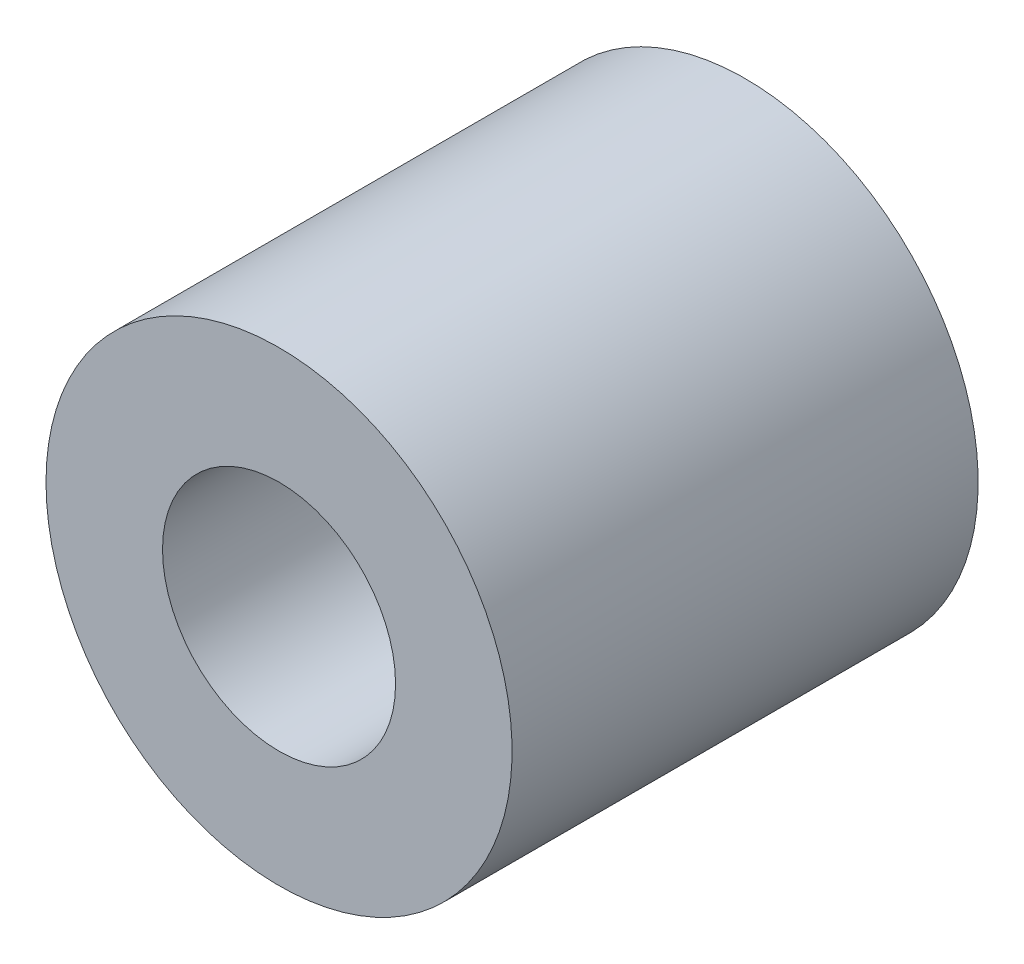
ISO-10303-21;
HEADER;
FILE_DESCRIPTION(('STEP AP214'),'2;1');
FILE_NAME('part.step','',(''),(''),'','','');
FILE_SCHEMA(('AUTOMOTIVE_DESIGN { 1 0 10303 214 1 1 1 1 }'));
ENDSEC;
DATA;
#1=APPLICATION_CONTEXT('core data for automotive mechanical design processes');
#2=APPLICATION_PROTOCOL_DEFINITION('international standard','automotive_design',2000,#1);
#3=PRODUCT_CONTEXT('',#1,'mechanical');
#4=PRODUCT('Part','Part','',(#3));
#5=PRODUCT_RELATED_PRODUCT_CATEGORY('part','',(#4));
#6=PRODUCT_DEFINITION_FORMATION('','',#4);
#7=PRODUCT_DEFINITION_CONTEXT('part definition',#1,'design');
#8=PRODUCT_DEFINITION('design','',#6,#7);
#9=PRODUCT_DEFINITION_SHAPE('','',#8);
#10=(LENGTH_UNIT() NAMED_UNIT(*) SI_UNIT(.MILLI.,.METRE.));
#11=(NAMED_UNIT(*) PLANE_ANGLE_UNIT() SI_UNIT($,.RADIAN.));
#12=(NAMED_UNIT(*) SI_UNIT($,.STERADIAN.) SOLID_ANGLE_UNIT());
#13=UNCERTAINTY_MEASURE_WITH_UNIT(LENGTH_MEASURE(1.E-05),#10,'distance_accuracy_value','');
#14=(GEOMETRIC_REPRESENTATION_CONTEXT(3) GLOBAL_UNCERTAINTY_ASSIGNED_CONTEXT((#13)) GLOBAL_UNIT_ASSIGNED_CONTEXT((#10,
#11,#12)) REPRESENTATION_CONTEXT('',''));
#15=CARTESIAN_POINT('',(0.,0.,0.));
#16=DIRECTION('',(0.,0.,1.));
#17=DIRECTION('',(1.,0.,0.));
#18=AXIS2_PLACEMENT_3D('',#15,#16,#17);
#19=CARTESIAN_POINT('',(0.,0.,-8.00000000000001));
#20=DIRECTION('',(0.,0.,1.));
#21=DIRECTION('',(-1.,0.,0.));
#22=AXIS2_PLACEMENT_3D('',#19,#20,#21);
#23=CYLINDRICAL_SURFACE('',#22,4.);
#24=CARTESIAN_POINT('',(0.,0.,-8.00000000000001));
#25=DIRECTION('',(0.,0.,1.));
#26=DIRECTION('',(1.,0.,0.));
#27=AXIS2_PLACEMENT_3D('',#24,#25,#26);
#28=CIRCLE('',#27,4.);
#29=CARTESIAN_POINT('',(-4.,0.,-8.00000000000001));
#30=VERTEX_POINT('',#29);
#31=EDGE_CURVE('E10',#30,#30,#28,.T.);
#32=CARTESIAN_POINT('',(0.,0.,0.));
#33=DIRECTION('',(0.,0.,1.));
#34=DIRECTION('',(1.,0.,0.));
#35=AXIS2_PLACEMENT_3D('',#32,#33,#34);
#36=CIRCLE('',#35,4.);
#37=CARTESIAN_POINT('',(-4.,0.,0.));
#38=VERTEX_POINT('',#37);
#39=EDGE_CURVE('E40',#38,#38,#36,.T.);
#40=CARTESIAN_POINT('',(-4.,0.,-8.00000000000001));
#41=CARTESIAN_POINT('',(-4.,0.,-7.91666666666668));
#42=CARTESIAN_POINT('',(-4.,0.,-7.83333333333334));
#43=CARTESIAN_POINT('',(-4.,0.,-7.66666666666667));
#44=CARTESIAN_POINT('',(-4.,0.,-7.58333333333334));
#45=CARTESIAN_POINT('',(-4.,0.,-7.41666666666667));
#46=CARTESIAN_POINT('',(-4.,0.,-7.33333333333334));
#47=CARTESIAN_POINT('',(-4.,0.,-7.16666666666667));
#48=CARTESIAN_POINT('',(-4.,0.,-7.08333333333334));
#49=CARTESIAN_POINT('',(-4.,0.,-6.91666666666667));
#50=CARTESIAN_POINT('',(-4.,0.,-6.83333333333334));
#51=CARTESIAN_POINT('',(-4.,0.,-6.66666666666667));
#52=CARTESIAN_POINT('',(-4.,0.,-6.58333333333334));
#53=CARTESIAN_POINT('',(-4.,0.,-6.41666666666667));
#54=CARTESIAN_POINT('',(-4.,0.,-6.33333333333334));
#55=CARTESIAN_POINT('',(-4.,0.,-6.16666666666667));
#56=CARTESIAN_POINT('',(-4.,0.,-6.08333333333334));
#57=CARTESIAN_POINT('',(-4.,0.,-5.91666666666667));
#58=CARTESIAN_POINT('',(-4.,0.,-5.83333333333334));
#59=CARTESIAN_POINT('',(-4.,0.,-5.66666666666667));
#60=CARTESIAN_POINT('',(-4.,0.,-5.58333333333334));
#61=CARTESIAN_POINT('',(-4.,0.,-5.41666666666667));
#62=CARTESIAN_POINT('',(-4.,0.,-5.33333333333334));
#63=CARTESIAN_POINT('',(-4.,0.,-5.16666666666667));
#64=CARTESIAN_POINT('',(-4.,0.,-5.08333333333334));
#65=CARTESIAN_POINT('',(-4.,0.,-4.91666666666667));
#66=CARTESIAN_POINT('',(-4.,0.,-4.83333333333334));
#67=CARTESIAN_POINT('',(-4.,0.,-4.66666666666667));
#68=CARTESIAN_POINT('',(-4.,0.,-4.58333333333334));
#69=CARTESIAN_POINT('',(-4.,0.,-4.41666666666667));
#70=CARTESIAN_POINT('',(-4.,0.,-4.33333333333334));
#71=CARTESIAN_POINT('',(-4.,0.,-4.16666666666667));
#72=CARTESIAN_POINT('',(-4.,0.,-4.08333333333334));
#73=CARTESIAN_POINT('',(-4.,0.,-3.91666666666667));
#74=CARTESIAN_POINT('',(-4.,0.,-3.83333333333334));
#75=CARTESIAN_POINT('',(-4.,0.,-3.66666666666667));
#76=CARTESIAN_POINT('',(-4.,0.,-3.58333333333334));
#77=CARTESIAN_POINT('',(-4.,0.,-3.41666666666667));
#78=CARTESIAN_POINT('',(-4.,0.,-3.33333333333334));
#79=CARTESIAN_POINT('',(-4.,0.,-3.16666666666667));
#80=CARTESIAN_POINT('',(-4.,0.,-3.08333333333334));
#81=CARTESIAN_POINT('',(-4.,0.,-2.91666666666667));
#82=CARTESIAN_POINT('',(-4.,0.,-2.83333333333334));
#83=CARTESIAN_POINT('',(-4.,0.,-2.66666666666667));
#84=CARTESIAN_POINT('',(-4.,0.,-2.58333333333334));
#85=CARTESIAN_POINT('',(-4.,0.,-2.41666666666667));
#86=CARTESIAN_POINT('',(-4.,0.,-2.33333333333334));
#87=CARTESIAN_POINT('',(-4.,0.,-2.16666666666667));
#88=CARTESIAN_POINT('',(-4.,0.,-2.08333333333334));
#89=CARTESIAN_POINT('',(-4.,0.,-1.91666666666667));
#90=CARTESIAN_POINT('',(-4.,0.,-1.83333333333333));
#91=CARTESIAN_POINT('',(-4.,0.,-1.66666666666667));
#92=CARTESIAN_POINT('',(-4.,0.,-1.58333333333333));
#93=CARTESIAN_POINT('',(-4.,0.,-1.41666666666667));
#94=CARTESIAN_POINT('',(-4.,0.,-1.33333333333333));
#95=CARTESIAN_POINT('',(-4.,0.,-1.16666666666667));
#96=CARTESIAN_POINT('',(-4.,0.,-1.08333333333333));
#97=CARTESIAN_POINT('',(-4.,0.,-0.916666666666668));
#98=CARTESIAN_POINT('',(-4.,0.,-0.833333333333334));
#99=CARTESIAN_POINT('',(-4.,0.,-0.666666666666667));
#100=CARTESIAN_POINT('',(-4.,0.,-0.583333333333333));
#101=CARTESIAN_POINT('',(-4.,0.,-0.416666666666666));
#102=CARTESIAN_POINT('',(-4.,0.,-0.333333333333333));
#103=CARTESIAN_POINT('',(-4.,0.,-0.166666666666666));
#104=CARTESIAN_POINT('',(-4.,0.,-0.0833333333333331));
#105=CARTESIAN_POINT('',(-4.,0.,0.));
#106=B_SPLINE_CURVE_WITH_KNOTS('',3,(#40,#41,#42,#43,#44,#45,#46,#47,#48,#49,#50,#51,#52,#53,
#54,#55,#56,#57,#58,#59,#60,#61,#62,#63,#64,#65,#66,#67,#68,#69,#70,#71,#72,#73,#74,#75,#76,#77,
#78,#79,#80,#81,#82,#83,#84,#85,#86,#87,#88,#89,#90,#91,#92,#93,#94,#95,#96,#97,#98,#99,#100,
#101,#102,#103,#104,#105),.UNSPECIFIED.,.F.,.F.,(4,2,2,2,2,2,2,2,2,2,2,2,2,2,2,2,2,2,2,2,2,2,2,
2,2,2,2,2,2,2,2,2,4),(0.,0.250000000000001,0.500000000000001,0.750000000000002,1.,1.25,1.5,1.75,
2.,2.25,2.5,2.75,3.,3.25,3.5,3.75,4.00000000000001,4.25000000000001,4.50000000000001,
4.75000000000001,5.00000000000001,5.25000000000001,5.50000000000001,5.75000000000001,
6.00000000000001,6.25000000000001,6.50000000000001,6.75000000000001,7.00000000000001,
7.25000000000001,7.50000000000001,7.75000000000001,8.00000000000001),.UNSPECIFIED.);
#107=EDGE_CURVE('BSEAM33',#30,#38,#106,.T.);
#108=ORIENTED_EDGE('',*,*,#31,.T.);
#109=ORIENTED_EDGE('',*,*,#39,.F.);
#110=ORIENTED_EDGE('',*,*,#107,.T.);
#111=ORIENTED_EDGE('',*,*,#107,.F.);
#112=EDGE_LOOP('',(#108,#110,#109,#111));
#113=FACE_BOUND('',#112,.T.);
#114=ADVANCED_FACE('F33',(#113),#23,.T.);
#115=CARTESIAN_POINT('',(0.,0.,-8.00000000000001));
#116=DIRECTION('',(0.,0.,-1.));
#117=DIRECTION('',(1.,0.,0.));
#118=AXIS2_PLACEMENT_3D('',#115,#116,#117);
#119=PLANE('',#118);
#120=CARTESIAN_POINT('',(0.,0.,-8.00000000000001));
#121=DIRECTION('',(0.,0.,1.));
#122=DIRECTION('',(1.,0.,0.));
#123=AXIS2_PLACEMENT_3D('',#120,#121,#122);
#124=CIRCLE('',#123,2.);
#125=CARTESIAN_POINT('',(2.,0.,-8.00000000000001));
#126=VERTEX_POINT('',#125);
#127=EDGE_CURVE('E46',#126,#126,#124,.T.);
#128=ORIENTED_EDGE('',*,*,#127,.T.);
#129=EDGE_LOOP('',(#128));
#130=FACE_BOUND('',#129,.T.);
#131=ORIENTED_EDGE('',*,*,#31,.F.);
#132=EDGE_LOOP('',(#131));
#133=FACE_BOUND('',#132,.T.);
#134=ADVANCED_FACE('F58',(#130,#133),#119,.T.);
#135=CARTESIAN_POINT('',(0.,0.,0.));
#136=DIRECTION('',(0.,0.,-1.));
#137=DIRECTION('',(1.,0.,0.));
#138=AXIS2_PLACEMENT_3D('',#135,#136,#137);
#139=PLANE('',#138);
#140=CARTESIAN_POINT('',(0.,0.,0.));
#141=DIRECTION('',(0.,0.,1.));
#142=DIRECTION('',(1.,0.,0.));
#143=AXIS2_PLACEMENT_3D('',#140,#141,#142);
#144=CIRCLE('',#143,2.);
#145=CARTESIAN_POINT('',(2.,0.,0.));
#146=VERTEX_POINT('',#145);
#147=EDGE_CURVE('E36',#146,#146,#144,.T.);
#148=ORIENTED_EDGE('',*,*,#147,.F.);
#149=EDGE_LOOP('',(#148));
#150=FACE_BOUND('',#149,.T.);
#151=ORIENTED_EDGE('',*,*,#39,.T.);
#152=EDGE_LOOP('',(#151));
#153=FACE_BOUND('',#152,.T.);
#154=ADVANCED_FACE('F55',(#150,#153),#139,.F.);
#155=CARTESIAN_POINT('',(0.,0.,7.00000000000001));
#156=DIRECTION('',(0.,0.,-1.));
#157=DIRECTION('',(1.,0.,0.));
#158=AXIS2_PLACEMENT_3D('',#155,#156,#157);
#159=CYLINDRICAL_SURFACE('',#158,2.);
#160=CARTESIAN_POINT('',(2.,0.,-8.00000000000001));
#161=CARTESIAN_POINT('',(2.,0.,-7.91666666666667));
#162=CARTESIAN_POINT('',(2.,0.,-7.83333333333334));
#163=CARTESIAN_POINT('',(2.,0.,-7.66666666666667));
#164=CARTESIAN_POINT('',(2.,0.,-7.58333333333334));
#165=CARTESIAN_POINT('',(2.,0.,-7.41666666666667));
#166=CARTESIAN_POINT('',(2.,0.,-7.33333333333334));
#167=CARTESIAN_POINT('',(2.,0.,-7.16666666666667));
#168=CARTESIAN_POINT('',(2.,0.,-7.08333333333334));
#169=CARTESIAN_POINT('',(2.,0.,-6.91666666666667));
#170=CARTESIAN_POINT('',(2.,0.,-6.83333333333334));
#171=CARTESIAN_POINT('',(2.,0.,-6.66666666666667));
#172=CARTESIAN_POINT('',(2.,0.,-6.58333333333334));
#173=CARTESIAN_POINT('',(2.,0.,-6.41666666666667));
#174=CARTESIAN_POINT('',(2.,0.,-6.33333333333334));
#175=CARTESIAN_POINT('',(2.,0.,-6.16666666666667));
#176=CARTESIAN_POINT('',(2.,0.,-6.08333333333334));
#177=CARTESIAN_POINT('',(2.,0.,-5.91666666666667));
#178=CARTESIAN_POINT('',(2.,0.,-5.83333333333334));
#179=CARTESIAN_POINT('',(2.,0.,-5.66666666666667));
#180=CARTESIAN_POINT('',(2.,0.,-5.58333333333334));
#181=CARTESIAN_POINT('',(2.,0.,-5.41666666666667));
#182=CARTESIAN_POINT('',(2.,0.,-5.33333333333334));
#183=CARTESIAN_POINT('',(2.,0.,-5.16666666666667));
#184=CARTESIAN_POINT('',(2.,0.,-5.08333333333334));
#185=CARTESIAN_POINT('',(2.,0.,-4.91666666666667));
#186=CARTESIAN_POINT('',(2.,0.,-4.83333333333334));
#187=CARTESIAN_POINT('',(2.,0.,-4.66666666666667));
#188=CARTESIAN_POINT('',(2.,0.,-4.58333333333334));
#189=CARTESIAN_POINT('',(2.,0.,-4.41666666666667));
#190=CARTESIAN_POINT('',(2.,0.,-4.33333333333334));
#191=CARTESIAN_POINT('',(2.,0.,-4.16666666666667));
#192=CARTESIAN_POINT('',(2.,0.,-4.08333333333334));
#193=CARTESIAN_POINT('',(2.,0.,-3.91666666666667));
#194=CARTESIAN_POINT('',(2.,0.,-3.83333333333334));
#195=CARTESIAN_POINT('',(2.,0.,-3.66666666666667));
#196=CARTESIAN_POINT('',(2.,0.,-3.58333333333334));
#197=CARTESIAN_POINT('',(2.,0.,-3.41666666666667));
#198=CARTESIAN_POINT('',(2.,0.,-3.33333333333334));
#199=CARTESIAN_POINT('',(2.,0.,-3.16666666666667));
#200=CARTESIAN_POINT('',(2.,0.,-3.08333333333334));
#201=CARTESIAN_POINT('',(2.,0.,-2.91666666666667));
#202=CARTESIAN_POINT('',(2.,0.,-2.83333333333334));
#203=CARTESIAN_POINT('',(2.,0.,-2.66666666666667));
#204=CARTESIAN_POINT('',(2.,0.,-2.58333333333334));
#205=CARTESIAN_POINT('',(2.,0.,-2.41666666666667));
#206=CARTESIAN_POINT('',(2.,0.,-2.33333333333334));
#207=CARTESIAN_POINT('',(2.,0.,-2.16666666666667));
#208=CARTESIAN_POINT('',(2.,0.,-2.08333333333334));
#209=CARTESIAN_POINT('',(2.,0.,-1.91666666666667));
#210=CARTESIAN_POINT('',(2.,0.,-1.83333333333334));
#211=CARTESIAN_POINT('',(2.,0.,-1.66666666666667));
#212=CARTESIAN_POINT('',(2.,0.,-1.58333333333333));
#213=CARTESIAN_POINT('',(2.,0.,-1.41666666666667));
#214=CARTESIAN_POINT('',(2.,0.,-1.33333333333333));
#215=CARTESIAN_POINT('',(2.,0.,-1.16666666666667));
#216=CARTESIAN_POINT('',(2.,0.,-1.08333333333333));
#217=CARTESIAN_POINT('',(2.,0.,-0.916666666666668));
#218=CARTESIAN_POINT('',(2.,0.,-0.833333333333334));
#219=CARTESIAN_POINT('',(2.,0.,-0.666666666666667));
#220=CARTESIAN_POINT('',(2.,0.,-0.583333333333334));
#221=CARTESIAN_POINT('',(2.,0.,-0.416666666666667));
#222=CARTESIAN_POINT('',(2.,0.,-0.333333333333334));
#223=CARTESIAN_POINT('',(2.,0.,-0.166666666666667));
#224=CARTESIAN_POINT('',(2.,0.,-0.0833333333333333));
#225=CARTESIAN_POINT('',(2.,0.,0.));
#226=B_SPLINE_CURVE_WITH_KNOTS('',3,(#160,#161,#162,#163,#164,#165,#166,#167,#168,#169,#170,
#171,#172,#173,#174,#175,#176,#177,#178,#179,#180,#181,#182,#183,#184,#185,#186,#187,#188,#189,
#190,#191,#192,#193,#194,#195,#196,#197,#198,#199,#200,#201,#202,#203,#204,#205,#206,#207,#208,
#209,#210,#211,#212,#213,#214,#215,#216,#217,#218,#219,#220,#221,#222,#223,#224,#225),
.UNSPECIFIED.,.F.,.F.,(4,2,2,2,2,2,2,2,2,2,2,2,2,2,2,2,2,2,2,2,2,2,2,2,2,2,2,2,2,2,2,2,4),(0.,
0.25,0.5,0.750000000000001,1.,1.25,1.5,1.75,2.,2.25,2.5,2.75,3.,3.25,3.5,3.75,4.,4.25,4.5,4.75,
5.,5.25,5.50000000000001,5.75000000000001,6.00000000000001,6.25000000000001,6.50000000000001,
6.75000000000001,7.00000000000001,7.25000000000001,7.50000000000001,7.75000000000001,
8.00000000000001),.UNSPECIFIED.);
#227=EDGE_CURVE('BSEAM53',#126,#146,#226,.T.);
#228=ORIENTED_EDGE('',*,*,#127,.F.);
#229=ORIENTED_EDGE('',*,*,#147,.T.);
#230=ORIENTED_EDGE('',*,*,#227,.T.);
#231=ORIENTED_EDGE('',*,*,#227,.F.);
#232=EDGE_LOOP('',(#228,#230,#229,#231));
#233=FACE_BOUND('',#232,.T.);
#234=ADVANCED_FACE('F53',(#233),#159,.F.);
#235=CLOSED_SHELL('',(#114,#134,#154,#234));
#236=MANIFOLD_SOLID_BREP('B2',#235);
#237=ADVANCED_BREP_SHAPE_REPRESENTATION('',(#18,#236),#14);
#238=SHAPE_DEFINITION_REPRESENTATION(#9,#237);
ENDSEC;
END-ISO-10303-21;
